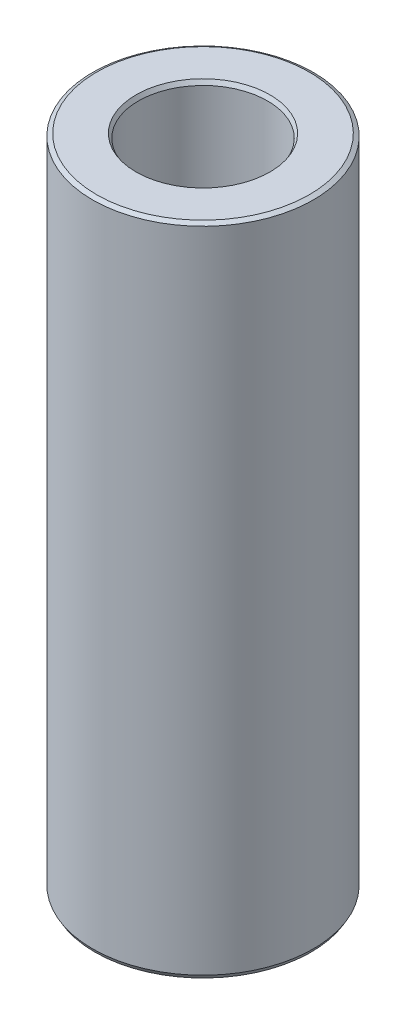
ISO-10303-21;
HEADER;
FILE_DESCRIPTION(('STEP AP214'),'2;1');
FILE_NAME('part.step','',(''),(''),'','','');
FILE_SCHEMA(('AUTOMOTIVE_DESIGN { 1 0 10303 214 1 1 1 1 }'));
ENDSEC;
DATA;
#1=APPLICATION_CONTEXT('core data for automotive mechanical design processes');
#2=APPLICATION_PROTOCOL_DEFINITION('international standard','automotive_design',2000,#1);
#3=PRODUCT_CONTEXT('',#1,'mechanical');
#4=PRODUCT('Part','Part','',(#3));
#5=PRODUCT_RELATED_PRODUCT_CATEGORY('part','',(#4));
#6=PRODUCT_DEFINITION_FORMATION('','',#4);
#7=PRODUCT_DEFINITION_CONTEXT('part definition',#1,'design');
#8=PRODUCT_DEFINITION('design','',#6,#7);
#9=PRODUCT_DEFINITION_SHAPE('','',#8);
#10=(LENGTH_UNIT() NAMED_UNIT(*) SI_UNIT(.MILLI.,.METRE.));
#11=(NAMED_UNIT(*) PLANE_ANGLE_UNIT() SI_UNIT($,.RADIAN.));
#12=(NAMED_UNIT(*) SI_UNIT($,.STERADIAN.) SOLID_ANGLE_UNIT());
#13=UNCERTAINTY_MEASURE_WITH_UNIT(LENGTH_MEASURE(1.E-05),#10,'distance_accuracy_value','');
#14=(GEOMETRIC_REPRESENTATION_CONTEXT(3) GLOBAL_UNCERTAINTY_ASSIGNED_CONTEXT((#13)) GLOBAL_UNIT_ASSIGNED_CONTEXT((#10,
#11,#12)) REPRESENTATION_CONTEXT('',''));
#15=CARTESIAN_POINT('',(0.,0.,0.));
#16=DIRECTION('',(0.,0.,1.));
#17=DIRECTION('',(1.,0.,0.));
#18=AXIS2_PLACEMENT_3D('',#15,#16,#17);
#19=CARTESIAN_POINT('',(0.,266.951392018828,0.));
#20=DIRECTION('',(0.,-1.,0.));
#21=DIRECTION('',(0.,0.,-1.));
#22=AXIS2_PLACEMENT_3D('',#19,#20,#21);
#23=CYLINDRICAL_SURFACE('',#22,45.);
#24=CARTESIAN_POINT('',(0.,1.68011679453478,0.));
#25=DIRECTION('',(0.,1.,0.));
#26=DIRECTION('',(0.,0.,1.));
#27=AXIS2_PLACEMENT_3D('',#24,#25,#26);
#28=CIRCLE('',#27,45.);
#29=CARTESIAN_POINT('',(0.,1.68011679453478,45.));
#30=VERTEX_POINT('',#29);
#31=EDGE_CURVE('E10',#30,#30,#28,.T.);
#32=ORIENTED_EDGE('',*,*,#31,.T.);
#33=EDGE_LOOP('',(#32));
#34=FACE_BOUND('',#33,.T.);
#35=CARTESIAN_POINT('',(0.,265.981376135233,0.));
#36=DIRECTION('',(0.,1.,0.));
#37=DIRECTION('',(0.,0.,1.));
#38=AXIS2_PLACEMENT_3D('',#35,#36,#37);
#39=CIRCLE('',#38,45.);
#40=CARTESIAN_POINT('',(0.,265.981376135233,45.));
#41=VERTEX_POINT('',#40);
#42=EDGE_CURVE('E50',#41,#41,#39,.F.);
#43=ORIENTED_EDGE('',*,*,#42,.T.);
#44=EDGE_LOOP('',(#43));
#45=FACE_BOUND('',#44,.T.);
#46=ADVANCED_FACE('F39',(#34,#45),#23,.T.);
#47=CARTESIAN_POINT('',(0.,266.951392018828,0.));
#48=DIRECTION('',(0.,1.,0.));
#49=DIRECTION('',(0.,0.,1.));
#50=AXIS2_PLACEMENT_3D('',#47,#48,#49);
#51=PLANE('',#50);
#52=CARTESIAN_POINT('',(0.,266.951392018828,0.));
#53=DIRECTION('',(0.,1.,0.));
#54=DIRECTION('',(0.,0.,1.));
#55=AXIS2_PLACEMENT_3D('',#52,#53,#54);
#56=CIRCLE('',#55,27.2764615790576);
#57=CARTESIAN_POINT('',(0.,266.951392018828,27.2764615790576));
#58=VERTEX_POINT('',#57);
#59=EDGE_CURVE('E58',#58,#58,#56,.F.);
#60=ORIENTED_EDGE('',*,*,#59,.T.);
#61=EDGE_LOOP('',(#60));
#62=FACE_BOUND('',#61,.T.);
#63=CARTESIAN_POINT('',(0.,266.951392018828,0.));
#64=DIRECTION('',(0.,1.,0.));
#65=DIRECTION('',(0.,0.,1.));
#66=AXIS2_PLACEMENT_3D('',#63,#64,#65);
#67=CIRCLE('',#66,43.3198832054652);
#68=CARTESIAN_POINT('',(0.,266.951392018828,43.3198832054652));
#69=VERTEX_POINT('',#68);
#70=EDGE_CURVE('E61',#69,#69,#67,.T.);
#71=ORIENTED_EDGE('',*,*,#70,.T.);
#72=EDGE_LOOP('',(#71));
#73=FACE_BOUND('',#72,.T.);
#74=ADVANCED_FACE('F88',(#62,#73),#51,.T.);
#75=CARTESIAN_POINT('',(0.,0.,0.));
#76=DIRECTION('',(0.,1.,0.));
#77=DIRECTION('',(0.,0.,1.));
#78=AXIS2_PLACEMENT_3D('',#75,#76,#77);
#79=PLANE('',#78);
#80=CARTESIAN_POINT('',(0.,0.,0.));
#81=DIRECTION('',(0.,1.,0.));
#82=DIRECTION('',(0.,0.,1.));
#83=AXIS2_PLACEMENT_3D('',#80,#81,#82);
#84=CIRCLE('',#83,27.9865624899977);
#85=CARTESIAN_POINT('',(0.,0.,27.9865624899977));
#86=VERTEX_POINT('',#85);
#87=EDGE_CURVE('E51',#86,#86,#84,.T.);
#88=ORIENTED_EDGE('',*,*,#87,.T.);
#89=EDGE_LOOP('',(#88));
#90=FACE_BOUND('',#89,.T.);
#91=CARTESIAN_POINT('',(0.,0.,0.));
#92=DIRECTION('',(0.,1.,0.));
#93=DIRECTION('',(0.,0.,1.));
#94=AXIS2_PLACEMENT_3D('',#91,#92,#93);
#95=CIRCLE('',#94,44.0299841164054);
#96=CARTESIAN_POINT('',(0.,0.,44.0299841164054));
#97=VERTEX_POINT('',#96);
#98=EDGE_CURVE('E54',#97,#97,#95,.F.);
#99=ORIENTED_EDGE('',*,*,#98,.T.);
#100=EDGE_LOOP('',(#99));
#101=FACE_BOUND('',#100,.T.);
#102=ADVANCED_FACE('F83',(#90,#101),#79,.F.);
#103=CARTESIAN_POINT('',(0.,266.951392018828,0.));
#104=DIRECTION('',(0.,-1.,0.));
#105=DIRECTION('',(0.,0.,-1.));
#106=AXIS2_PLACEMENT_3D('',#103,#104,#105);
#107=CYLINDRICAL_SURFACE('',#106,26.3064456954629);
#108=CARTESIAN_POINT('',(0.,265.271275224293,0.));
#109=DIRECTION('',(0.,1.,0.));
#110=DIRECTION('',(0.,0.,1.));
#111=AXIS2_PLACEMENT_3D('',#108,#109,#110);
#112=CIRCLE('',#111,26.3064456954629);
#113=CARTESIAN_POINT('',(0.,265.271275224293,26.3064456954629));
#114=VERTEX_POINT('',#113);
#115=EDGE_CURVE('E67',#114,#114,#112,.T.);
#116=ORIENTED_EDGE('',*,*,#115,.T.);
#117=EDGE_LOOP('',(#116));
#118=FACE_BOUND('',#117,.T.);
#119=CARTESIAN_POINT('',(0.,0.970015883594688,0.));
#120=DIRECTION('',(0.,1.,0.));
#121=DIRECTION('',(0.,0.,1.));
#122=AXIS2_PLACEMENT_3D('',#119,#120,#121);
#123=CIRCLE('',#122,26.3064456954629);
#124=CARTESIAN_POINT('',(0.,0.970015883594688,26.3064456954629));
#125=VERTEX_POINT('',#124);
#126=EDGE_CURVE('E69',#125,#125,#123,.F.);
#127=ORIENTED_EDGE('',*,*,#126,.T.);
#128=EDGE_LOOP('',(#127));
#129=FACE_BOUND('',#128,.T.);
#130=ADVANCED_FACE('F71',(#118,#129),#107,.F.);
#131=CARTESIAN_POINT('',(0.,265.271275224293,0.));
#132=DIRECTION('',(0.,1.,0.));
#133=DIRECTION('',(0.,0.,1.));
#134=AXIS2_PLACEMENT_3D('',#131,#132,#133);
#135=CONICAL_SURFACE('',#134,26.3064456954629,0.523598775598282);
#136=ORIENTED_EDGE('',*,*,#59,.F.);
#137=EDGE_LOOP('',(#136));
#138=FACE_BOUND('',#137,.T.);
#139=ORIENTED_EDGE('',*,*,#115,.F.);
#140=EDGE_LOOP('',(#139));
#141=FACE_BOUND('',#140,.T.);
#142=ADVANCED_FACE('F77',(#138,#141),#135,.F.);
#143=CARTESIAN_POINT('',(0.,0.,0.));
#144=DIRECTION('',(0.,-1.,0.));
#145=DIRECTION('',(0.,0.,-1.));
#146=AXIS2_PLACEMENT_3D('',#143,#144,#145);
#147=CONICAL_SURFACE('',#146,27.9865624899977,1.0471975511966);
#148=ORIENTED_EDGE('',*,*,#126,.F.);
#149=EDGE_LOOP('',(#148));
#150=FACE_BOUND('',#149,.T.);
#151=ORIENTED_EDGE('',*,*,#87,.F.);
#152=EDGE_LOOP('',(#151));
#153=FACE_BOUND('',#152,.T.);
#154=ADVANCED_FACE('F73',(#150,#153),#147,.F.);
#155=CARTESIAN_POINT('',(0.,1.68011679453478,0.));
#156=DIRECTION('',(0.,1.,0.));
#157=DIRECTION('',(0.,0.,1.));
#158=AXIS2_PLACEMENT_3D('',#155,#156,#157);
#159=CONICAL_SURFACE('',#158,45.,0.523598775598293);
#160=ORIENTED_EDGE('',*,*,#98,.F.);
#161=EDGE_LOOP('',(#160));
#162=FACE_BOUND('',#161,.T.);
#163=ORIENTED_EDGE('',*,*,#31,.F.);
#164=EDGE_LOOP('',(#163));
#165=FACE_BOUND('',#164,.T.);
#166=ADVANCED_FACE('F76',(#162,#165),#159,.T.);
#167=CARTESIAN_POINT('',(0.,266.951392018828,0.));
#168=DIRECTION('',(0.,-1.,0.));
#169=DIRECTION('',(0.,0.,-1.));
#170=AXIS2_PLACEMENT_3D('',#167,#168,#169);
#171=CONICAL_SURFACE('',#170,43.3198832054652,1.04719755119659);
#172=ORIENTED_EDGE('',*,*,#42,.F.);
#173=EDGE_LOOP('',(#172));
#174=FACE_BOUND('',#173,.T.);
#175=ORIENTED_EDGE('',*,*,#70,.F.);
#176=EDGE_LOOP('',(#175));
#177=FACE_BOUND('',#176,.T.);
#178=ADVANCED_FACE('F45',(#174,#177),#171,.T.);
#179=CLOSED_SHELL('',(#46,#74,#102,#130,#142,#154,#166,#178));
#180=MANIFOLD_SOLID_BREP('B2',#179);
#181=ADVANCED_BREP_SHAPE_REPRESENTATION('',(#18,#180),#14);
#182=SHAPE_DEFINITION_REPRESENTATION(#9,#181);
ENDSEC;
END-ISO-10303-21;
